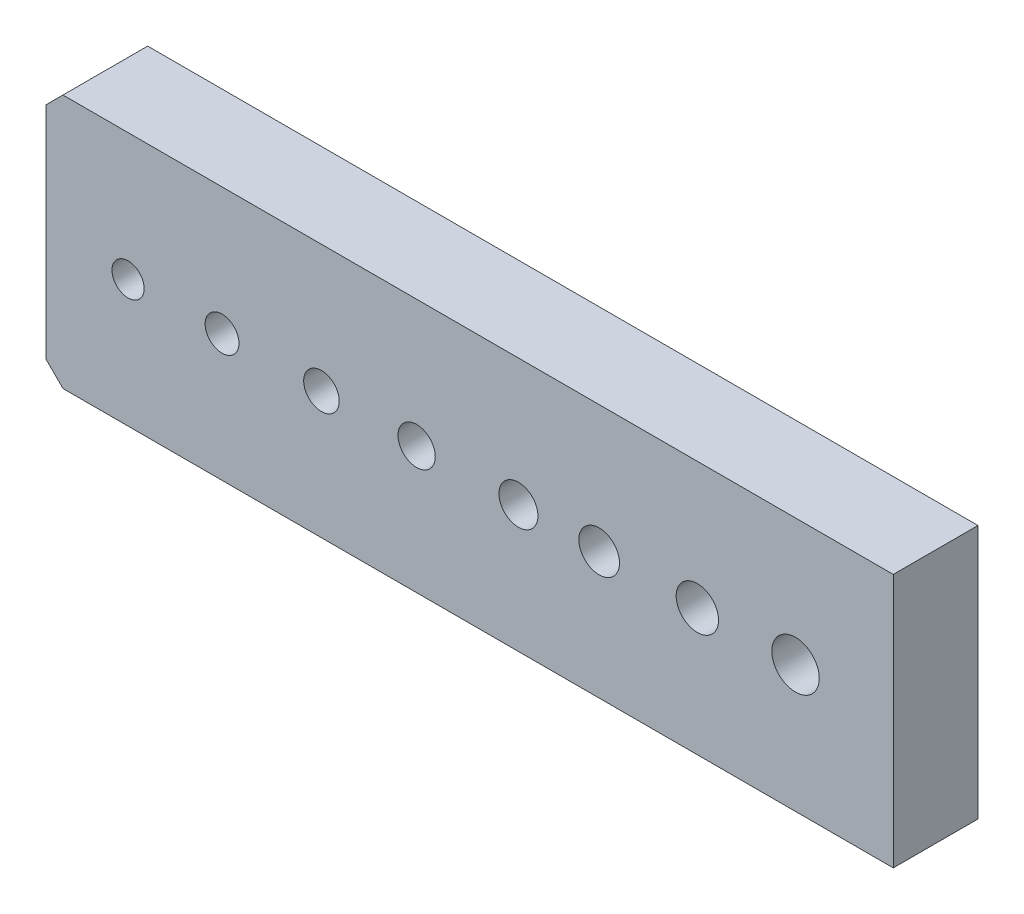
ISO-10303-21;
HEADER;
FILE_DESCRIPTION(('STEP AP214'),'2;1');
FILE_NAME('part.step','',(''),(''),'','','');
FILE_SCHEMA(('AUTOMOTIVE_DESIGN { 1 0 10303 214 1 1 1 1 }'));
ENDSEC;
DATA;
#1=APPLICATION_CONTEXT('core data for automotive mechanical design processes');
#2=APPLICATION_PROTOCOL_DEFINITION('international standard','automotive_design',2000,#1);
#3=PRODUCT_CONTEXT('',#1,'mechanical');
#4=PRODUCT('Part','Part','',(#3));
#5=PRODUCT_RELATED_PRODUCT_CATEGORY('part','',(#4));
#6=PRODUCT_DEFINITION_FORMATION('','',#4);
#7=PRODUCT_DEFINITION_CONTEXT('part definition',#1,'design');
#8=PRODUCT_DEFINITION('design','',#6,#7);
#9=PRODUCT_DEFINITION_SHAPE('','',#8);
#10=(LENGTH_UNIT() NAMED_UNIT(*) SI_UNIT(.MILLI.,.METRE.));
#11=(NAMED_UNIT(*) PLANE_ANGLE_UNIT() SI_UNIT($,.RADIAN.));
#12=(NAMED_UNIT(*) SI_UNIT($,.STERADIAN.) SOLID_ANGLE_UNIT());
#13=UNCERTAINTY_MEASURE_WITH_UNIT(LENGTH_MEASURE(1.E-05),#10,'distance_accuracy_value','');
#14=(GEOMETRIC_REPRESENTATION_CONTEXT(3) GLOBAL_UNCERTAINTY_ASSIGNED_CONTEXT((#13)) GLOBAL_UNIT_ASSIGNED_CONTEXT((#10,
#11,#12)) REPRESENTATION_CONTEXT('',''));
#15=CARTESIAN_POINT('',(0.,0.,0.));
#16=DIRECTION('',(0.,0.,1.));
#17=DIRECTION('',(1.,0.,0.));
#18=AXIS2_PLACEMENT_3D('',#15,#16,#17);
#19=CARTESIAN_POINT('',(25.,-7.5,5.));
#20=DIRECTION('',(-1.,0.,0.));
#21=DIRECTION('',(0.,0.,1.));
#22=AXIS2_PLACEMENT_3D('',#19,#20,#21);
#23=PLANE('',#22);
#24=DIRECTION('',(0.,1.,0.));
#25=VECTOR('',#24,1.);
#26=CARTESIAN_POINT('',(25.,-7.5,0.));
#27=LINE('',#26,#25);
#28=CARTESIAN_POINT('',(25.,-7.5,0.));
#29=VERTEX_POINT('',#28);
#30=CARTESIAN_POINT('',(25.,7.5,0.));
#31=VERTEX_POINT('',#30);
#32=EDGE_CURVE('E115',#29,#31,#27,.T.);
#33=ORIENTED_EDGE('',*,*,#32,.T.);
#34=DIRECTION('',(0.,0.,-1.));
#35=VECTOR('',#34,1.);
#36=CARTESIAN_POINT('',(25.,7.5,5.));
#37=LINE('',#36,#35);
#38=CARTESIAN_POINT('',(25.,7.5,5.));
#39=VERTEX_POINT('',#38);
#40=EDGE_CURVE('E96',#39,#31,#37,.T.);
#41=ORIENTED_EDGE('',*,*,#40,.F.);
#42=DIRECTION('',(0.,1.,0.));
#43=VECTOR('',#42,1.);
#44=CARTESIAN_POINT('',(25.,-7.5,5.));
#45=LINE('',#44,#43);
#46=CARTESIAN_POINT('',(25.,-7.5,5.));
#47=VERTEX_POINT('',#46);
#48=EDGE_CURVE('E102',#47,#39,#45,.T.);
#49=ORIENTED_EDGE('',*,*,#48,.F.);
#50=DIRECTION('',(0.,0.,-1.));
#51=VECTOR('',#50,1.);
#52=CARTESIAN_POINT('',(25.,-7.5,5.));
#53=LINE('',#52,#51);
#54=EDGE_CURVE('E118',#47,#29,#53,.T.);
#55=ORIENTED_EDGE('',*,*,#54,.T.);
#56=EDGE_LOOP('',(#33,#41,#49,#55));
#57=FACE_BOUND('',#56,.T.);
#58=ADVANCED_FACE('F39',(#57),#23,.F.);
#59=CARTESIAN_POINT('',(-25.,7.5,5.));
#60=DIRECTION('',(0.,-1.,0.));
#61=DIRECTION('',(0.,0.,-1.));
#62=AXIS2_PLACEMENT_3D('',#59,#60,#61);
#63=PLANE('',#62);
#64=DIRECTION('',(-1.,0.,0.));
#65=VECTOR('',#64,1.);
#66=CARTESIAN_POINT('',(-25.,7.5,0.));
#67=LINE('',#66,#65);
#68=CARTESIAN_POINT('',(-24.,7.5,0.));
#69=VERTEX_POINT('',#68);
#70=EDGE_CURVE('E158',#31,#69,#67,.T.);
#71=ORIENTED_EDGE('',*,*,#70,.T.);
#72=DIRECTION('',(0.,0.,1.));
#73=VECTOR('',#72,1.);
#74=CARTESIAN_POINT('',(-24.,7.5,5.));
#75=LINE('',#74,#73);
#76=CARTESIAN_POINT('',(-24.,7.5,5.));
#77=VERTEX_POINT('',#76);
#78=EDGE_CURVE('E11',#69,#77,#75,.T.);
#79=ORIENTED_EDGE('',*,*,#78,.T.);
#80=DIRECTION('',(-1.,0.,0.));
#81=VECTOR('',#80,1.);
#82=CARTESIAN_POINT('',(-25.,7.5,5.));
#83=LINE('',#82,#81);
#84=EDGE_CURVE('E92',#39,#77,#83,.T.);
#85=ORIENTED_EDGE('',*,*,#84,.F.);
#86=ORIENTED_EDGE('',*,*,#40,.T.);
#87=EDGE_LOOP('',(#71,#79,#85,#86));
#88=FACE_BOUND('',#87,.T.);
#89=ADVANCED_FACE('F94',(#88),#63,.F.);
#90=CARTESIAN_POINT('',(-25.,-7.5,5.));
#91=DIRECTION('',(1.,0.,0.));
#92=DIRECTION('',(0.,0.,-1.));
#93=AXIS2_PLACEMENT_3D('',#90,#91,#92);
#94=PLANE('',#93);
#95=DIRECTION('',(0.,-1.,0.));
#96=VECTOR('',#95,1.);
#97=CARTESIAN_POINT('',(-25.,-7.5,0.));
#98=LINE('',#97,#96);
#99=CARTESIAN_POINT('',(-25.,6.5,0.));
#100=VERTEX_POINT('',#99);
#101=CARTESIAN_POINT('',(-25.,-6.49999999999999,0.));
#102=VERTEX_POINT('',#101);
#103=EDGE_CURVE('E154',#100,#102,#98,.T.);
#104=ORIENTED_EDGE('',*,*,#103,.T.);
#105=DIRECTION('',(0.,0.,1.));
#106=VECTOR('',#105,1.);
#107=CARTESIAN_POINT('',(-25.,-6.49999999999999,5.));
#108=LINE('',#107,#106);
#109=CARTESIAN_POINT('',(-25.,-6.49999999999999,5.));
#110=VERTEX_POINT('',#109);
#111=EDGE_CURVE('E61',#102,#110,#108,.T.);
#112=ORIENTED_EDGE('',*,*,#111,.T.);
#113=DIRECTION('',(0.,-1.,0.));
#114=VECTOR('',#113,1.);
#115=CARTESIAN_POINT('',(-25.,-7.5,5.));
#116=LINE('',#115,#114);
#117=CARTESIAN_POINT('',(-25.,6.5,5.));
#118=VERTEX_POINT('',#117);
#119=EDGE_CURVE('E101',#118,#110,#116,.T.);
#120=ORIENTED_EDGE('',*,*,#119,.F.);
#121=DIRECTION('',(0.,0.,-1.));
#122=VECTOR('',#121,1.);
#123=CARTESIAN_POINT('',(-25.,6.5,5.));
#124=LINE('',#123,#122);
#125=EDGE_CURVE('E133',#118,#100,#124,.T.);
#126=ORIENTED_EDGE('',*,*,#125,.T.);
#127=EDGE_LOOP('',(#104,#112,#120,#126));
#128=FACE_BOUND('',#127,.T.);
#129=ADVANCED_FACE('F155',(#128),#94,.F.);
#130=CARTESIAN_POINT('',(-25.,-7.5,5.));
#131=DIRECTION('',(0.,1.,0.));
#132=DIRECTION('',(0.,0.,1.));
#133=AXIS2_PLACEMENT_3D('',#130,#131,#132);
#134=PLANE('',#133);
#135=DIRECTION('',(1.,0.,0.));
#136=VECTOR('',#135,1.);
#137=CARTESIAN_POINT('',(-25.,-7.5,5.));
#138=LINE('',#137,#136);
#139=CARTESIAN_POINT('',(-24.,-7.5,5.));
#140=VERTEX_POINT('',#139);
#141=EDGE_CURVE('E107',#140,#47,#138,.T.);
#142=ORIENTED_EDGE('',*,*,#141,.F.);
#143=DIRECTION('',(0.,0.,-1.));
#144=VECTOR('',#143,1.);
#145=CARTESIAN_POINT('',(-24.,-7.5,5.));
#146=LINE('',#145,#144);
#147=CARTESIAN_POINT('',(-24.,-7.5,0.));
#148=VERTEX_POINT('',#147);
#149=EDGE_CURVE('E117',#140,#148,#146,.T.);
#150=ORIENTED_EDGE('',*,*,#149,.T.);
#151=DIRECTION('',(1.,0.,0.));
#152=VECTOR('',#151,1.);
#153=CARTESIAN_POINT('',(-25.,-7.5,0.));
#154=LINE('',#153,#152);
#155=EDGE_CURVE('E112',#148,#29,#154,.T.);
#156=ORIENTED_EDGE('',*,*,#155,.T.);
#157=ORIENTED_EDGE('',*,*,#54,.F.);
#158=EDGE_LOOP('',(#142,#150,#156,#157));
#159=FACE_BOUND('',#158,.T.);
#160=ADVANCED_FACE('F146',(#159),#134,.F.);
#161=CARTESIAN_POINT('',(0.,0.,5.));
#162=DIRECTION('',(0.,0.,-1.));
#163=DIRECTION('',(-1.,0.,0.));
#164=AXIS2_PLACEMENT_3D('',#161,#162,#163);
#165=PLANE('',#164);
#166=CARTESIAN_POINT('',(-20.1566578134904,0.,5.));
#167=DIRECTION('',(0.,0.,1.));
#168=DIRECTION('',(1.,0.,0.));
#169=AXIS2_PLACEMENT_3D('',#166,#167,#168);
#170=CIRCLE('',#169,0.950000000000001);
#171=CARTESIAN_POINT('',(-19.2066578134904,0.,5.));
#172=VERTEX_POINT('',#171);
#173=EDGE_CURVE('E225',#172,#172,#170,.T.);
#174=ORIENTED_EDGE('',*,*,#173,.F.);
#175=EDGE_LOOP('',(#174));
#176=FACE_BOUND('',#175,.T.);
#177=CARTESIAN_POINT('',(-14.610910690202,0.,5.));
#178=DIRECTION('',(0.,0.,1.));
#179=DIRECTION('',(1.,0.,0.));
#180=AXIS2_PLACEMENT_3D('',#177,#178,#179);
#181=CIRCLE('',#180,1.);
#182=CARTESIAN_POINT('',(-13.610910690202,0.,5.));
#183=VERTEX_POINT('',#182);
#184=EDGE_CURVE('E217',#183,#183,#181,.T.);
#185=ORIENTED_EDGE('',*,*,#184,.F.);
#186=EDGE_LOOP('',(#185));
#187=FACE_BOUND('',#186,.T.);
#188=CARTESIAN_POINT('',(-8.74521661749317,0.,5.));
#189=DIRECTION('',(0.,0.,1.));
#190=DIRECTION('',(1.,0.,0.));
#191=AXIS2_PLACEMENT_3D('',#188,#189,#190);
#192=CIRCLE('',#191,1.05);
#193=CARTESIAN_POINT('',(-7.69521661749317,0.,5.));
#194=VERTEX_POINT('',#193);
#195=EDGE_CURVE('E209',#194,#194,#192,.T.);
#196=ORIENTED_EDGE('',*,*,#195,.F.);
#197=EDGE_LOOP('',(#196));
#198=FACE_BOUND('',#197,.T.);
#199=CARTESIAN_POINT('',(-3.12837017211143,0.,5.));
#200=DIRECTION('',(0.,0.,1.));
#201=DIRECTION('',(1.,0.,0.));
#202=AXIS2_PLACEMENT_3D('',#199,#200,#201);
#203=CIRCLE('',#202,1.1);
#204=CARTESIAN_POINT('',(-2.02837017211143,0.,5.));
#205=VERTEX_POINT('',#204);
#206=EDGE_CURVE('E201',#205,#205,#203,.T.);
#207=ORIENTED_EDGE('',*,*,#206,.F.);
#208=EDGE_LOOP('',(#207));
#209=FACE_BOUND('',#208,.T.);
#210=CARTESIAN_POINT('',(2.87952254478441,0.,5.));
#211=DIRECTION('',(0.,0.,1.));
#212=DIRECTION('',(1.,0.,0.));
#213=AXIS2_PLACEMENT_3D('',#210,#211,#212);
#214=CIRCLE('',#213,1.15);
#215=CARTESIAN_POINT('',(4.02952254478441,0.,5.));
#216=VERTEX_POINT('',#215);
#217=EDGE_CURVE('E193',#216,#216,#214,.T.);
#218=ORIENTED_EDGE('',*,*,#217,.F.);
#219=EDGE_LOOP('',(#218));
#220=FACE_BOUND('',#219,.T.);
#221=CARTESIAN_POINT('',(7.64317712504492,0.,5.));
#222=DIRECTION('',(0.,0.,1.));
#223=DIRECTION('',(1.,0.,0.));
#224=AXIS2_PLACEMENT_3D('',#221,#222,#223);
#225=CIRCLE('',#224,1.2);
#226=CARTESIAN_POINT('',(8.84317712504492,0.,5.));
#227=VERTEX_POINT('',#226);
#228=EDGE_CURVE('E185',#227,#227,#225,.T.);
#229=ORIENTED_EDGE('',*,*,#228,.F.);
#230=EDGE_LOOP('',(#229));
#231=FACE_BOUND('',#230,.T.);
#232=CARTESIAN_POINT('',(13.4377718756602,0.,5.));
#233=DIRECTION('',(0.,0.,1.));
#234=DIRECTION('',(1.,0.,0.));
#235=AXIS2_PLACEMENT_3D('',#232,#233,#234);
#236=CIRCLE('',#235,1.25);
#237=CARTESIAN_POINT('',(14.6877718756602,0.,5.));
#238=VERTEX_POINT('',#237);
#239=EDGE_CURVE('E177',#238,#238,#236,.T.);
#240=ORIENTED_EDGE('',*,*,#239,.F.);
#241=EDGE_LOOP('',(#240));
#242=FACE_BOUND('',#241,.T.);
#243=CARTESIAN_POINT('',(19.2323666262757,0.,5.));
#244=DIRECTION('',(0.,0.,1.));
#245=DIRECTION('',(1.,0.,0.));
#246=AXIS2_PLACEMENT_3D('',#243,#244,#245);
#247=CIRCLE('',#246,1.4);
#248=CARTESIAN_POINT('',(20.6323666262757,0.,5.));
#249=VERTEX_POINT('',#248);
#250=EDGE_CURVE('E169',#249,#249,#247,.T.);
#251=ORIENTED_EDGE('',*,*,#250,.F.);
#252=EDGE_LOOP('',(#251));
#253=FACE_BOUND('',#252,.T.);
#254=ORIENTED_EDGE('',*,*,#119,.T.);
#255=DIRECTION('',(-0.707106781186545,0.70710678118655,0.));
#256=VECTOR('',#255,1.);
#257=CARTESIAN_POINT('',(-24.,-7.5,5.));
#258=LINE('',#257,#256);
#259=EDGE_CURVE('E48',#110,#140,#258,.F.);
#260=ORIENTED_EDGE('',*,*,#259,.T.);
#261=ORIENTED_EDGE('',*,*,#141,.T.);
#262=ORIENTED_EDGE('',*,*,#48,.T.);
#263=ORIENTED_EDGE('',*,*,#84,.T.);
#264=DIRECTION('',(0.70710678118655,0.707106781186545,0.));
#265=VECTOR('',#264,1.);
#266=CARTESIAN_POINT('',(-25.,6.5,5.));
#267=LINE('',#266,#265);
#268=EDGE_CURVE('E139',#77,#118,#267,.F.);
#269=ORIENTED_EDGE('',*,*,#268,.T.);
#270=EDGE_LOOP('',(#254,#260,#261,#262,#263,#269));
#271=FACE_BOUND('',#270,.T.);
#272=ADVANCED_FACE('F105',(#176,#187,#198,#209,#220,#231,#242,#253,#271),#165,.F.);
#273=CARTESIAN_POINT('',(0.,0.,0.));
#274=DIRECTION('',(0.,0.,-1.));
#275=DIRECTION('',(-1.,0.,0.));
#276=AXIS2_PLACEMENT_3D('',#273,#274,#275);
#277=PLANE('',#276);
#278=CARTESIAN_POINT('',(-20.1566578134904,0.,0.));
#279=DIRECTION('',(0.,0.,1.));
#280=DIRECTION('',(1.,0.,0.));
#281=AXIS2_PLACEMENT_3D('',#278,#279,#280);
#282=CIRCLE('',#281,0.950000000000001);
#283=CARTESIAN_POINT('',(-19.2066578134904,0.,0.));
#284=VERTEX_POINT('',#283);
#285=EDGE_CURVE('E165',#284,#284,#282,.T.);
#286=ORIENTED_EDGE('',*,*,#285,.T.);
#287=EDGE_LOOP('',(#286));
#288=FACE_BOUND('',#287,.T.);
#289=CARTESIAN_POINT('',(-14.610910690202,0.,0.));
#290=DIRECTION('',(0.,0.,1.));
#291=DIRECTION('',(1.,0.,0.));
#292=AXIS2_PLACEMENT_3D('',#289,#290,#291);
#293=CIRCLE('',#292,1.);
#294=CARTESIAN_POINT('',(-13.610910690202,0.,0.));
#295=VERTEX_POINT('',#294);
#296=EDGE_CURVE('E221',#295,#295,#293,.T.);
#297=ORIENTED_EDGE('',*,*,#296,.T.);
#298=EDGE_LOOP('',(#297));
#299=FACE_BOUND('',#298,.T.);
#300=CARTESIAN_POINT('',(-8.74521661749317,0.,0.));
#301=DIRECTION('',(0.,0.,1.));
#302=DIRECTION('',(1.,0.,0.));
#303=AXIS2_PLACEMENT_3D('',#300,#301,#302);
#304=CIRCLE('',#303,1.05);
#305=CARTESIAN_POINT('',(-7.69521661749317,0.,0.));
#306=VERTEX_POINT('',#305);
#307=EDGE_CURVE('E213',#306,#306,#304,.T.);
#308=ORIENTED_EDGE('',*,*,#307,.T.);
#309=EDGE_LOOP('',(#308));
#310=FACE_BOUND('',#309,.T.);
#311=CARTESIAN_POINT('',(-3.12837017211143,0.,0.));
#312=DIRECTION('',(0.,0.,1.));
#313=DIRECTION('',(1.,0.,0.));
#314=AXIS2_PLACEMENT_3D('',#311,#312,#313);
#315=CIRCLE('',#314,1.1);
#316=CARTESIAN_POINT('',(-2.02837017211143,0.,0.));
#317=VERTEX_POINT('',#316);
#318=EDGE_CURVE('E205',#317,#317,#315,.T.);
#319=ORIENTED_EDGE('',*,*,#318,.T.);
#320=EDGE_LOOP('',(#319));
#321=FACE_BOUND('',#320,.T.);
#322=CARTESIAN_POINT('',(2.87952254478441,0.,0.));
#323=DIRECTION('',(0.,0.,1.));
#324=DIRECTION('',(1.,0.,0.));
#325=AXIS2_PLACEMENT_3D('',#322,#323,#324);
#326=CIRCLE('',#325,1.15);
#327=CARTESIAN_POINT('',(4.02952254478441,0.,0.));
#328=VERTEX_POINT('',#327);
#329=EDGE_CURVE('E197',#328,#328,#326,.T.);
#330=ORIENTED_EDGE('',*,*,#329,.T.);
#331=EDGE_LOOP('',(#330));
#332=FACE_BOUND('',#331,.T.);
#333=CARTESIAN_POINT('',(7.64317712504492,0.,0.));
#334=DIRECTION('',(0.,0.,1.));
#335=DIRECTION('',(1.,0.,0.));
#336=AXIS2_PLACEMENT_3D('',#333,#334,#335);
#337=CIRCLE('',#336,1.2);
#338=CARTESIAN_POINT('',(8.84317712504492,0.,0.));
#339=VERTEX_POINT('',#338);
#340=EDGE_CURVE('E189',#339,#339,#337,.T.);
#341=ORIENTED_EDGE('',*,*,#340,.T.);
#342=EDGE_LOOP('',(#341));
#343=FACE_BOUND('',#342,.T.);
#344=CARTESIAN_POINT('',(13.4377718756602,0.,0.));
#345=DIRECTION('',(0.,0.,1.));
#346=DIRECTION('',(1.,0.,0.));
#347=AXIS2_PLACEMENT_3D('',#344,#345,#346);
#348=CIRCLE('',#347,1.25);
#349=CARTESIAN_POINT('',(14.6877718756602,0.,0.));
#350=VERTEX_POINT('',#349);
#351=EDGE_CURVE('E181',#350,#350,#348,.T.);
#352=ORIENTED_EDGE('',*,*,#351,.T.);
#353=EDGE_LOOP('',(#352));
#354=FACE_BOUND('',#353,.T.);
#355=CARTESIAN_POINT('',(19.2323666262757,0.,0.));
#356=DIRECTION('',(0.,0.,1.));
#357=DIRECTION('',(1.,0.,0.));
#358=AXIS2_PLACEMENT_3D('',#355,#356,#357);
#359=CIRCLE('',#358,1.4);
#360=CARTESIAN_POINT('',(20.6323666262757,0.,0.));
#361=VERTEX_POINT('',#360);
#362=EDGE_CURVE('E173',#361,#361,#359,.T.);
#363=ORIENTED_EDGE('',*,*,#362,.T.);
#364=EDGE_LOOP('',(#363));
#365=FACE_BOUND('',#364,.T.);
#366=ORIENTED_EDGE('',*,*,#155,.F.);
#367=DIRECTION('',(0.707106781186545,-0.70710678118655,0.));
#368=VECTOR('',#367,1.);
#369=CARTESIAN_POINT('',(-15.7500000000001,-15.75,0.));
#370=LINE('',#369,#368);
#371=EDGE_CURVE('E130',#148,#102,#370,.F.);
#372=ORIENTED_EDGE('',*,*,#371,.T.);
#373=ORIENTED_EDGE('',*,*,#103,.F.);
#374=DIRECTION('',(-0.70710678118655,-0.707106781186545,0.));
#375=VECTOR('',#374,1.);
#376=CARTESIAN_POINT('',(-15.7499999999999,15.75,0.));
#377=LINE('',#376,#375);
#378=EDGE_CURVE('E123',#100,#69,#377,.F.);
#379=ORIENTED_EDGE('',*,*,#378,.T.);
#380=ORIENTED_EDGE('',*,*,#70,.F.);
#381=ORIENTED_EDGE('',*,*,#32,.F.);
#382=EDGE_LOOP('',(#366,#372,#373,#379,#380,#381));
#383=FACE_BOUND('',#382,.T.);
#384=ADVANCED_FACE('F153',(#288,#299,#310,#321,#332,#343,#354,#365,#383),#277,.T.);
#385=CARTESIAN_POINT('',(19.2323666262757,0.,0.));
#386=DIRECTION('',(0.,0.,1.));
#387=DIRECTION('',(1.,0.,0.));
#388=AXIS2_PLACEMENT_3D('',#385,#386,#387);
#389=CYLINDRICAL_SURFACE('',#388,1.4);
#390=ORIENTED_EDGE('',*,*,#362,.F.);
#391=EDGE_LOOP('',(#390));
#392=FACE_BOUND('',#391,.T.);
#393=ORIENTED_EDGE('',*,*,#250,.T.);
#394=EDGE_LOOP('',(#393));
#395=FACE_BOUND('',#394,.T.);
#396=ADVANCED_FACE('F259',(#392,#395),#389,.F.);
#397=CARTESIAN_POINT('',(13.4377718756602,0.,0.));
#398=DIRECTION('',(0.,0.,1.));
#399=DIRECTION('',(1.,0.,0.));
#400=AXIS2_PLACEMENT_3D('',#397,#398,#399);
#401=CYLINDRICAL_SURFACE('',#400,1.25);
#402=ORIENTED_EDGE('',*,*,#351,.F.);
#403=EDGE_LOOP('',(#402));
#404=FACE_BOUND('',#403,.T.);
#405=ORIENTED_EDGE('',*,*,#239,.T.);
#406=EDGE_LOOP('',(#405));
#407=FACE_BOUND('',#406,.T.);
#408=ADVANCED_FACE('F261',(#404,#407),#401,.F.);
#409=CARTESIAN_POINT('',(7.64317712504492,0.,0.));
#410=DIRECTION('',(0.,0.,1.));
#411=DIRECTION('',(1.,0.,0.));
#412=AXIS2_PLACEMENT_3D('',#409,#410,#411);
#413=CYLINDRICAL_SURFACE('',#412,1.2);
#414=ORIENTED_EDGE('',*,*,#340,.F.);
#415=EDGE_LOOP('',(#414));
#416=FACE_BOUND('',#415,.T.);
#417=ORIENTED_EDGE('',*,*,#228,.T.);
#418=EDGE_LOOP('',(#417));
#419=FACE_BOUND('',#418,.T.);
#420=ADVANCED_FACE('F268',(#416,#419),#413,.F.);
#421=CARTESIAN_POINT('',(2.87952254478441,0.,0.));
#422=DIRECTION('',(0.,0.,1.));
#423=DIRECTION('',(1.,0.,0.));
#424=AXIS2_PLACEMENT_3D('',#421,#422,#423);
#425=CYLINDRICAL_SURFACE('',#424,1.15);
#426=ORIENTED_EDGE('',*,*,#329,.F.);
#427=EDGE_LOOP('',(#426));
#428=FACE_BOUND('',#427,.T.);
#429=ORIENTED_EDGE('',*,*,#217,.T.);
#430=EDGE_LOOP('',(#429));
#431=FACE_BOUND('',#430,.T.);
#432=ADVANCED_FACE('F361',(#428,#431),#425,.F.);
#433=CARTESIAN_POINT('',(-3.12837017211143,0.,0.));
#434=DIRECTION('',(0.,0.,1.));
#435=DIRECTION('',(1.,0.,0.));
#436=AXIS2_PLACEMENT_3D('',#433,#434,#435);
#437=CYLINDRICAL_SURFACE('',#436,1.1);
#438=ORIENTED_EDGE('',*,*,#318,.F.);
#439=EDGE_LOOP('',(#438));
#440=FACE_BOUND('',#439,.T.);
#441=ORIENTED_EDGE('',*,*,#206,.T.);
#442=EDGE_LOOP('',(#441));
#443=FACE_BOUND('',#442,.T.);
#444=ADVANCED_FACE('F351',(#440,#443),#437,.F.);
#445=CARTESIAN_POINT('',(-8.74521661749317,0.,0.));
#446=DIRECTION('',(0.,0.,1.));
#447=DIRECTION('',(1.,0.,0.));
#448=AXIS2_PLACEMENT_3D('',#445,#446,#447);
#449=CYLINDRICAL_SURFACE('',#448,1.05);
#450=ORIENTED_EDGE('',*,*,#307,.F.);
#451=EDGE_LOOP('',(#450));
#452=FACE_BOUND('',#451,.T.);
#453=ORIENTED_EDGE('',*,*,#195,.T.);
#454=EDGE_LOOP('',(#453));
#455=FACE_BOUND('',#454,.T.);
#456=ADVANCED_FACE('F341',(#452,#455),#449,.F.);
#457=CARTESIAN_POINT('',(-14.610910690202,0.,0.));
#458=DIRECTION('',(0.,0.,1.));
#459=DIRECTION('',(1.,0.,0.));
#460=AXIS2_PLACEMENT_3D('',#457,#458,#459);
#461=CYLINDRICAL_SURFACE('',#460,1.);
#462=ORIENTED_EDGE('',*,*,#296,.F.);
#463=EDGE_LOOP('',(#462));
#464=FACE_BOUND('',#463,.T.);
#465=ORIENTED_EDGE('',*,*,#184,.T.);
#466=EDGE_LOOP('',(#465));
#467=FACE_BOUND('',#466,.T.);
#468=ADVANCED_FACE('F238',(#464,#467),#461,.F.);
#469=CARTESIAN_POINT('',(-20.1566578134904,0.,0.));
#470=DIRECTION('',(0.,0.,1.));
#471=DIRECTION('',(1.,0.,0.));
#472=AXIS2_PLACEMENT_3D('',#469,#470,#471);
#473=CYLINDRICAL_SURFACE('',#472,0.950000000000001);
#474=ORIENTED_EDGE('',*,*,#285,.F.);
#475=EDGE_LOOP('',(#474));
#476=FACE_BOUND('',#475,.T.);
#477=ORIENTED_EDGE('',*,*,#173,.T.);
#478=EDGE_LOOP('',(#477));
#479=FACE_BOUND('',#478,.T.);
#480=ADVANCED_FACE('F235',(#476,#479),#473,.F.);
#481=CARTESIAN_POINT('',(-24.,-7.5,5.));
#482=DIRECTION('',(0.70710678118655,0.707106781186545,0.));
#483=DIRECTION('',(0.,0.,-1.));
#484=AXIS2_PLACEMENT_3D('',#481,#482,#483);
#485=PLANE('',#484);
#486=ORIENTED_EDGE('',*,*,#259,.F.);
#487=ORIENTED_EDGE('',*,*,#111,.F.);
#488=ORIENTED_EDGE('',*,*,#371,.F.);
#489=ORIENTED_EDGE('',*,*,#149,.F.);
#490=EDGE_LOOP('',(#486,#487,#488,#489));
#491=FACE_BOUND('',#490,.T.);
#492=ADVANCED_FACE('F150',(#491),#485,.F.);
#493=CARTESIAN_POINT('',(-25.,6.5,5.));
#494=DIRECTION('',(0.707106781186545,-0.70710678118655,0.));
#495=DIRECTION('',(0.,0.,-1.));
#496=AXIS2_PLACEMENT_3D('',#493,#494,#495);
#497=PLANE('',#496);
#498=ORIENTED_EDGE('',*,*,#268,.F.);
#499=ORIENTED_EDGE('',*,*,#78,.F.);
#500=ORIENTED_EDGE('',*,*,#378,.F.);
#501=ORIENTED_EDGE('',*,*,#125,.F.);
#502=EDGE_LOOP('',(#498,#499,#500,#501));
#503=FACE_BOUND('',#502,.T.);
#504=ADVANCED_FACE('F41',(#503),#497,.F.);
#505=CLOSED_SHELL('',(#58,#89,#129,#160,#272,#384,#396,#408,#420,#432,#444,#456,#468,#480,#492,#504));
#506=MANIFOLD_SOLID_BREP('B2',#505);
#507=ADVANCED_BREP_SHAPE_REPRESENTATION('',(#18,#506),#14);
#508=SHAPE_DEFINITION_REPRESENTATION(#9,#507);
ENDSEC;
END-ISO-10303-21;
